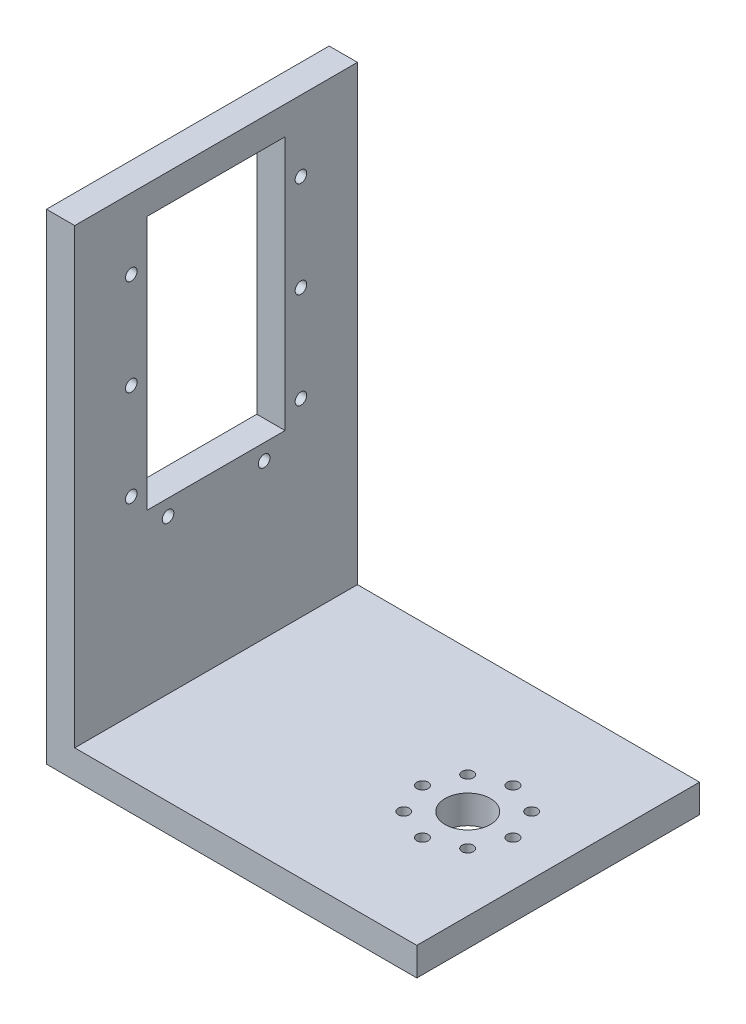
ISO-10303-21;
HEADER;
FILE_DESCRIPTION(('STEP AP214'),'2;1');
FILE_NAME('part.step','',(''),(''),'','','');
FILE_SCHEMA(('AUTOMOTIVE_DESIGN { 1 0 10303 214 1 1 1 1 }'));
ENDSEC;
DATA;
#1=APPLICATION_CONTEXT('core data for automotive mechanical design processes');
#2=APPLICATION_PROTOCOL_DEFINITION('international standard','automotive_design',2000,#1);
#3=PRODUCT_CONTEXT('',#1,'mechanical');
#4=PRODUCT('Part','Part','',(#3));
#5=PRODUCT_RELATED_PRODUCT_CATEGORY('part','',(#4));
#6=PRODUCT_DEFINITION_FORMATION('','',#4);
#7=PRODUCT_DEFINITION_CONTEXT('part definition',#1,'design');
#8=PRODUCT_DEFINITION('design','',#6,#7);
#9=PRODUCT_DEFINITION_SHAPE('','',#8);
#10=(LENGTH_UNIT() NAMED_UNIT(*) SI_UNIT(.MILLI.,.METRE.));
#11=(NAMED_UNIT(*) PLANE_ANGLE_UNIT() SI_UNIT($,.RADIAN.));
#12=(NAMED_UNIT(*) SI_UNIT($,.STERADIAN.) SOLID_ANGLE_UNIT());
#13=UNCERTAINTY_MEASURE_WITH_UNIT(LENGTH_MEASURE(1.E-05),#10,'distance_accuracy_value','');
#14=(GEOMETRIC_REPRESENTATION_CONTEXT(3) GLOBAL_UNCERTAINTY_ASSIGNED_CONTEXT((#13)) GLOBAL_UNIT_ASSIGNED_CONTEXT((#10,
#11,#12)) REPRESENTATION_CONTEXT('',''));
#15=CARTESIAN_POINT('',(0.,0.,0.));
#16=DIRECTION('',(0.,0.,1.));
#17=DIRECTION('',(1.,0.,0.));
#18=AXIS2_PLACEMENT_3D('',#15,#16,#17);
#19=CARTESIAN_POINT('',(0.,5.,0.));
#20=DIRECTION('',(0.,-1.,0.));
#21=DIRECTION('',(0.,0.,-1.));
#22=AXIS2_PLACEMENT_3D('',#19,#20,#21);
#23=PLANE('',#22);
#24=CARTESIAN_POINT('',(43.8431457505076,5.,-30.6568542494924));
#25=DIRECTION('',(0.,1.,0.));
#26=DIRECTION('',(0.,0.,1.));
#27=AXIS2_PLACEMENT_3D('',#24,#25,#26);
#28=CIRCLE('',#27,0.999999999999998);
#29=CARTESIAN_POINT('',(43.8431457505076,5.,-29.6568542494924));
#30=VERTEX_POINT('',#29);
#31=EDGE_CURVE('E166',#30,#30,#28,.T.);
#32=ORIENTED_EDGE('',*,*,#31,.F.);
#33=EDGE_LOOP('',(#32));
#34=FACE_BOUND('',#33,.T.);
#35=CARTESIAN_POINT('',(41.5,5.,-25.));
#36=DIRECTION('',(0.,1.,0.));
#37=DIRECTION('',(0.,0.,1.));
#38=AXIS2_PLACEMENT_3D('',#35,#36,#37);
#39=CIRCLE('',#38,0.999999999999998);
#40=CARTESIAN_POINT('',(41.5,5.,-24.));
#41=VERTEX_POINT('',#40);
#42=EDGE_CURVE('E172',#41,#41,#39,.T.);
#43=ORIENTED_EDGE('',*,*,#42,.F.);
#44=EDGE_LOOP('',(#43));
#45=FACE_BOUND('',#44,.T.);
#46=CARTESIAN_POINT('',(43.8431457505076,5.,-19.3431457505076));
#47=DIRECTION('',(0.,1.,0.));
#48=DIRECTION('',(0.,0.,1.));
#49=AXIS2_PLACEMENT_3D('',#46,#47,#48);
#50=CIRCLE('',#49,0.999999999999998);
#51=CARTESIAN_POINT('',(43.8431457505076,5.,-18.3431457505076));
#52=VERTEX_POINT('',#51);
#53=EDGE_CURVE('E178',#52,#52,#50,.T.);
#54=ORIENTED_EDGE('',*,*,#53,.F.);
#55=EDGE_LOOP('',(#54));
#56=FACE_BOUND('',#55,.T.);
#57=CARTESIAN_POINT('',(49.5,5.,-17.));
#58=DIRECTION('',(0.,1.,0.));
#59=DIRECTION('',(0.,0.,1.));
#60=AXIS2_PLACEMENT_3D('',#57,#58,#59);
#61=CIRCLE('',#60,0.999999999999998);
#62=CARTESIAN_POINT('',(49.5,5.,-16.));
#63=VERTEX_POINT('',#62);
#64=EDGE_CURVE('E184',#63,#63,#61,.T.);
#65=ORIENTED_EDGE('',*,*,#64,.F.);
#66=EDGE_LOOP('',(#65));
#67=FACE_BOUND('',#66,.T.);
#68=CARTESIAN_POINT('',(55.1568542494924,5.,-19.3431457505076));
#69=DIRECTION('',(0.,1.,0.));
#70=DIRECTION('',(0.,0.,1.));
#71=AXIS2_PLACEMENT_3D('',#68,#69,#70);
#72=CIRCLE('',#71,0.999999999999998);
#73=CARTESIAN_POINT('',(55.1568542494924,5.,-18.3431457505076));
#74=VERTEX_POINT('',#73);
#75=EDGE_CURVE('E190',#74,#74,#72,.T.);
#76=ORIENTED_EDGE('',*,*,#75,.F.);
#77=EDGE_LOOP('',(#76));
#78=FACE_BOUND('',#77,.T.);
#79=CARTESIAN_POINT('',(57.5,5.,-25.));
#80=DIRECTION('',(0.,1.,0.));
#81=DIRECTION('',(0.,0.,1.));
#82=AXIS2_PLACEMENT_3D('',#79,#80,#81);
#83=CIRCLE('',#82,0.999999999999998);
#84=CARTESIAN_POINT('',(57.5,5.,-24.));
#85=VERTEX_POINT('',#84);
#86=EDGE_CURVE('E196',#85,#85,#83,.T.);
#87=ORIENTED_EDGE('',*,*,#86,.F.);
#88=EDGE_LOOP('',(#87));
#89=FACE_BOUND('',#88,.T.);
#90=CARTESIAN_POINT('',(55.1568542494924,5.,-30.6568542494924));
#91=DIRECTION('',(0.,1.,0.));
#92=DIRECTION('',(0.,0.,1.));
#93=AXIS2_PLACEMENT_3D('',#90,#91,#92);
#94=CIRCLE('',#93,0.999999999999998);
#95=CARTESIAN_POINT('',(55.1568542494924,5.,-29.6568542494924));
#96=VERTEX_POINT('',#95);
#97=EDGE_CURVE('E202',#96,#96,#94,.T.);
#98=ORIENTED_EDGE('',*,*,#97,.F.);
#99=EDGE_LOOP('',(#98));
#100=FACE_BOUND('',#99,.T.);
#101=CARTESIAN_POINT('',(49.5,5.,-33.));
#102=DIRECTION('',(0.,1.,0.));
#103=DIRECTION('',(0.,0.,1.));
#104=AXIS2_PLACEMENT_3D('',#101,#102,#103);
#105=CIRCLE('',#104,0.999999999999998);
#106=CARTESIAN_POINT('',(49.5,5.,-32.));
#107=VERTEX_POINT('',#106);
#108=EDGE_CURVE('E208',#107,#107,#105,.T.);
#109=ORIENTED_EDGE('',*,*,#108,.F.);
#110=EDGE_LOOP('',(#109));
#111=FACE_BOUND('',#110,.T.);
#112=CARTESIAN_POINT('',(49.5,5.,-25.));
#113=DIRECTION('',(0.,1.,0.));
#114=DIRECTION('',(0.,0.,1.));
#115=AXIS2_PLACEMENT_3D('',#112,#113,#114);
#116=CIRCLE('',#115,4.00000000000001);
#117=CARTESIAN_POINT('',(49.5,5.,-21.));
#118=VERTEX_POINT('',#117);
#119=EDGE_CURVE('E214',#118,#118,#116,.T.);
#120=ORIENTED_EDGE('',*,*,#119,.F.);
#121=EDGE_LOOP('',(#120));
#122=FACE_BOUND('',#121,.T.);
#123=DIRECTION('',(0.,0.,-1.));
#124=VECTOR('',#123,1.);
#125=CARTESIAN_POINT('',(5.,5.,0.));
#126=LINE('',#125,#124);
#127=CARTESIAN_POINT('',(5.,5.,0.));
#128=VERTEX_POINT('',#127);
#129=CARTESIAN_POINT('',(5.,5.,-50.));
#130=VERTEX_POINT('',#129);
#131=EDGE_CURVE('E162',#128,#130,#126,.T.);
#132=ORIENTED_EDGE('',*,*,#131,.F.);
#133=DIRECTION('',(1.,0.,0.));
#134=VECTOR('',#133,1.);
#135=CARTESIAN_POINT('',(0.,5.,0.));
#136=LINE('',#135,#134);
#137=CARTESIAN_POINT('',(65.5,5.,0.));
#138=VERTEX_POINT('',#137);
#139=EDGE_CURVE('E220',#128,#138,#136,.T.);
#140=ORIENTED_EDGE('',*,*,#139,.T.);
#141=DIRECTION('',(0.,0.,-1.));
#142=VECTOR('',#141,1.);
#143=CARTESIAN_POINT('',(65.5,5.,0.));
#144=LINE('',#143,#142);
#145=CARTESIAN_POINT('',(65.5,5.,-50.));
#146=VERTEX_POINT('',#145);
#147=EDGE_CURVE('E222',#138,#146,#144,.T.);
#148=ORIENTED_EDGE('',*,*,#147,.T.);
#149=DIRECTION('',(-1.,0.,0.));
#150=VECTOR('',#149,1.);
#151=CARTESIAN_POINT('',(0.,5.,-50.));
#152=LINE('',#151,#150);
#153=EDGE_CURVE('E225',#146,#130,#152,.T.);
#154=ORIENTED_EDGE('',*,*,#153,.T.);
#155=EDGE_LOOP('',(#132,#140,#148,#154));
#156=FACE_BOUND('',#155,.T.);
#157=ADVANCED_FACE('F39',(#34,#45,#56,#67,#78,#89,#100,#111,#122,#156),#23,.F.);
#158=CARTESIAN_POINT('',(0.,0.,0.));
#159=DIRECTION('',(0.,-1.,0.));
#160=DIRECTION('',(0.,0.,-1.));
#161=AXIS2_PLACEMENT_3D('',#158,#159,#160);
#162=PLANE('',#161);
#163=DIRECTION('',(0.,0.,1.));
#164=VECTOR('',#163,1.);
#165=CARTESIAN_POINT('',(0.,0.,0.));
#166=LINE('',#165,#164);
#167=CARTESIAN_POINT('',(0.,0.,-50.));
#168=VERTEX_POINT('',#167);
#169=CARTESIAN_POINT('',(0.,0.,0.));
#170=VERTEX_POINT('',#169);
#171=EDGE_CURVE('E217',#168,#170,#166,.T.);
#172=ORIENTED_EDGE('',*,*,#171,.F.);
#173=DIRECTION('',(-1.,0.,0.));
#174=VECTOR('',#173,1.);
#175=CARTESIAN_POINT('',(0.,0.,-50.));
#176=LINE('',#175,#174);
#177=CARTESIAN_POINT('',(65.5,0.,-50.));
#178=VERTEX_POINT('',#177);
#179=EDGE_CURVE('E223',#178,#168,#176,.T.);
#180=ORIENTED_EDGE('',*,*,#179,.F.);
#181=DIRECTION('',(0.,0.,-1.));
#182=VECTOR('',#181,1.);
#183=CARTESIAN_POINT('',(65.5,0.,0.));
#184=LINE('',#183,#182);
#185=CARTESIAN_POINT('',(65.5,0.,0.));
#186=VERTEX_POINT('',#185);
#187=EDGE_CURVE('E232',#186,#178,#184,.T.);
#188=ORIENTED_EDGE('',*,*,#187,.F.);
#189=DIRECTION('',(1.,0.,0.));
#190=VECTOR('',#189,1.);
#191=CARTESIAN_POINT('',(0.,0.,0.));
#192=LINE('',#191,#190);
#193=EDGE_CURVE('E230',#170,#186,#192,.T.);
#194=ORIENTED_EDGE('',*,*,#193,.F.);
#195=EDGE_LOOP('',(#172,#180,#188,#194));
#196=FACE_BOUND('',#195,.T.);
#197=CARTESIAN_POINT('',(41.5,0.,-25.));
#198=DIRECTION('',(0.,1.,0.));
#199=DIRECTION('',(0.,0.,1.));
#200=AXIS2_PLACEMENT_3D('',#197,#198,#199);
#201=CIRCLE('',#200,0.999999999999998);
#202=CARTESIAN_POINT('',(41.5,0.,-24.));
#203=VERTEX_POINT('',#202);
#204=EDGE_CURVE('E169',#203,#203,#201,.T.);
#205=ORIENTED_EDGE('',*,*,#204,.T.);
#206=EDGE_LOOP('',(#205));
#207=FACE_BOUND('',#206,.T.);
#208=CARTESIAN_POINT('',(49.5,0.,-17.));
#209=DIRECTION('',(0.,1.,0.));
#210=DIRECTION('',(0.,0.,1.));
#211=AXIS2_PLACEMENT_3D('',#208,#209,#210);
#212=CIRCLE('',#211,0.999999999999998);
#213=CARTESIAN_POINT('',(49.5,0.,-16.));
#214=VERTEX_POINT('',#213);
#215=EDGE_CURVE('E181',#214,#214,#212,.T.);
#216=ORIENTED_EDGE('',*,*,#215,.T.);
#217=EDGE_LOOP('',(#216));
#218=FACE_BOUND('',#217,.T.);
#219=CARTESIAN_POINT('',(57.5,0.,-25.));
#220=DIRECTION('',(0.,1.,0.));
#221=DIRECTION('',(0.,0.,1.));
#222=AXIS2_PLACEMENT_3D('',#219,#220,#221);
#223=CIRCLE('',#222,0.999999999999998);
#224=CARTESIAN_POINT('',(57.5,0.,-24.));
#225=VERTEX_POINT('',#224);
#226=EDGE_CURVE('E193',#225,#225,#223,.T.);
#227=ORIENTED_EDGE('',*,*,#226,.T.);
#228=EDGE_LOOP('',(#227));
#229=FACE_BOUND('',#228,.T.);
#230=CARTESIAN_POINT('',(49.5,0.,-33.));
#231=DIRECTION('',(0.,1.,0.));
#232=DIRECTION('',(0.,0.,1.));
#233=AXIS2_PLACEMENT_3D('',#230,#231,#232);
#234=CIRCLE('',#233,0.999999999999998);
#235=CARTESIAN_POINT('',(49.5,0.,-32.));
#236=VERTEX_POINT('',#235);
#237=EDGE_CURVE('E205',#236,#236,#234,.T.);
#238=ORIENTED_EDGE('',*,*,#237,.T.);
#239=EDGE_LOOP('',(#238));
#240=FACE_BOUND('',#239,.T.);
#241=CARTESIAN_POINT('',(49.5,0.,-25.));
#242=DIRECTION('',(0.,1.,0.));
#243=DIRECTION('',(0.,0.,1.));
#244=AXIS2_PLACEMENT_3D('',#241,#242,#243);
#245=CIRCLE('',#244,4.00000000000001);
#246=CARTESIAN_POINT('',(49.5,0.,-21.));
#247=VERTEX_POINT('',#246);
#248=EDGE_CURVE('E211',#247,#247,#245,.T.);
#249=ORIENTED_EDGE('',*,*,#248,.T.);
#250=EDGE_LOOP('',(#249));
#251=FACE_BOUND('',#250,.T.);
#252=CARTESIAN_POINT('',(55.1568542494924,0.,-30.6568542494924));
#253=DIRECTION('',(0.,1.,0.));
#254=DIRECTION('',(0.,0.,1.));
#255=AXIS2_PLACEMENT_3D('',#252,#253,#254);
#256=CIRCLE('',#255,0.999999999999998);
#257=CARTESIAN_POINT('',(55.1568542494924,0.,-29.6568542494924));
#258=VERTEX_POINT('',#257);
#259=EDGE_CURVE('E199',#258,#258,#256,.T.);
#260=ORIENTED_EDGE('',*,*,#259,.T.);
#261=EDGE_LOOP('',(#260));
#262=FACE_BOUND('',#261,.T.);
#263=CARTESIAN_POINT('',(55.1568542494924,0.,-19.3431457505076));
#264=DIRECTION('',(0.,1.,0.));
#265=DIRECTION('',(0.,0.,1.));
#266=AXIS2_PLACEMENT_3D('',#263,#264,#265);
#267=CIRCLE('',#266,0.999999999999998);
#268=CARTESIAN_POINT('',(55.1568542494924,0.,-18.3431457505076));
#269=VERTEX_POINT('',#268);
#270=EDGE_CURVE('E187',#269,#269,#267,.T.);
#271=ORIENTED_EDGE('',*,*,#270,.T.);
#272=EDGE_LOOP('',(#271));
#273=FACE_BOUND('',#272,.T.);
#274=CARTESIAN_POINT('',(43.8431457505076,0.,-19.3431457505076));
#275=DIRECTION('',(0.,1.,0.));
#276=DIRECTION('',(0.,0.,1.));
#277=AXIS2_PLACEMENT_3D('',#274,#275,#276);
#278=CIRCLE('',#277,0.999999999999998);
#279=CARTESIAN_POINT('',(43.8431457505076,0.,-18.3431457505076));
#280=VERTEX_POINT('',#279);
#281=EDGE_CURVE('E175',#280,#280,#278,.T.);
#282=ORIENTED_EDGE('',*,*,#281,.T.);
#283=EDGE_LOOP('',(#282));
#284=FACE_BOUND('',#283,.T.);
#285=CARTESIAN_POINT('',(43.8431457505076,0.,-30.6568542494924));
#286=DIRECTION('',(0.,1.,0.));
#287=DIRECTION('',(0.,0.,1.));
#288=AXIS2_PLACEMENT_3D('',#285,#286,#287);
#289=CIRCLE('',#288,0.999999999999998);
#290=CARTESIAN_POINT('',(43.8431457505076,0.,-29.6568542494924));
#291=VERTEX_POINT('',#290);
#292=EDGE_CURVE('E165',#291,#291,#289,.T.);
#293=ORIENTED_EDGE('',*,*,#292,.T.);
#294=EDGE_LOOP('',(#293));
#295=FACE_BOUND('',#294,.T.);
#296=ADVANCED_FACE('F290',(#196,#207,#218,#229,#240,#251,#262,#273,#284,#295),#162,.T.);
#297=CARTESIAN_POINT('',(0.,5.,0.));
#298=DIRECTION('',(1.,0.,0.));
#299=DIRECTION('',(0.,0.,-1.));
#300=AXIS2_PLACEMENT_3D('',#297,#298,#299);
#301=PLANE('',#300);
#302=CARTESIAN_POINT('',(0.,72.5,-40.));
#303=DIRECTION('',(-1.,0.,0.));
#304=DIRECTION('',(0.,0.,1.));
#305=AXIS2_PLACEMENT_3D('',#302,#303,#304);
#306=CIRCLE('',#305,1.025);
#307=CARTESIAN_POINT('',(0.,72.5,-38.975));
#308=VERTEX_POINT('',#307);
#309=EDGE_CURVE('E614',#308,#308,#306,.T.);
#310=ORIENTED_EDGE('',*,*,#309,.F.);
#311=EDGE_LOOP('',(#310));
#312=FACE_BOUND('',#311,.T.);
#313=CARTESIAN_POINT('',(0.,72.5,-10.));
#314=DIRECTION('',(-1.,0.,0.));
#315=DIRECTION('',(0.,0.,1.));
#316=AXIS2_PLACEMENT_3D('',#313,#314,#315);
#317=CIRCLE('',#316,1.025);
#318=CARTESIAN_POINT('',(0.,72.5,-8.975));
#319=VERTEX_POINT('',#318);
#320=EDGE_CURVE('E615',#319,#319,#317,.T.);
#321=ORIENTED_EDGE('',*,*,#320,.F.);
#322=EDGE_LOOP('',(#321));
#323=FACE_BOUND('',#322,.T.);
#324=CARTESIAN_POINT('',(0.,55.5,-40.));
#325=DIRECTION('',(-1.,0.,0.));
#326=DIRECTION('',(0.,0.,1.));
#327=AXIS2_PLACEMENT_3D('',#324,#325,#326);
#328=CIRCLE('',#327,1.025);
#329=CARTESIAN_POINT('',(0.,55.5,-38.975));
#330=VERTEX_POINT('',#329);
#331=EDGE_CURVE('E599',#330,#330,#328,.T.);
#332=ORIENTED_EDGE('',*,*,#331,.F.);
#333=EDGE_LOOP('',(#332));
#334=FACE_BOUND('',#333,.T.);
#335=CARTESIAN_POINT('',(0.,38.5,-40.));
#336=DIRECTION('',(-1.,0.,0.));
#337=DIRECTION('',(0.,0.,1.));
#338=AXIS2_PLACEMENT_3D('',#335,#336,#337);
#339=CIRCLE('',#338,1.025);
#340=CARTESIAN_POINT('',(0.,38.5,-38.975));
#341=VERTEX_POINT('',#340);
#342=EDGE_CURVE('E618',#341,#341,#339,.T.);
#343=ORIENTED_EDGE('',*,*,#342,.F.);
#344=EDGE_LOOP('',(#343));
#345=FACE_BOUND('',#344,.T.);
#346=CARTESIAN_POINT('',(0.,38.5,-10.));
#347=DIRECTION('',(-1.,0.,0.));
#348=DIRECTION('',(0.,0.,-1.));
#349=AXIS2_PLACEMENT_3D('',#346,#347,#348);
#350=CIRCLE('',#349,1.025);
#351=CARTESIAN_POINT('',(0.,38.5,-11.025));
#352=VERTEX_POINT('',#351);
#353=EDGE_CURVE('E631',#352,#352,#350,.T.);
#354=ORIENTED_EDGE('',*,*,#353,.F.);
#355=EDGE_LOOP('',(#354));
#356=FACE_BOUND('',#355,.T.);
#357=CARTESIAN_POINT('',(0.,32.2,-33.5));
#358=DIRECTION('',(-1.,0.,0.));
#359=DIRECTION('',(0.,0.,1.));
#360=AXIS2_PLACEMENT_3D('',#357,#358,#359);
#361=CIRCLE('',#360,1.025);
#362=CARTESIAN_POINT('',(0.,32.2,-32.475));
#363=VERTEX_POINT('',#362);
#364=EDGE_CURVE('E628',#363,#363,#361,.T.);
#365=ORIENTED_EDGE('',*,*,#364,.F.);
#366=EDGE_LOOP('',(#365));
#367=FACE_BOUND('',#366,.T.);
#368=CARTESIAN_POINT('',(0.,55.5,-10.));
#369=DIRECTION('',(-1.,0.,0.));
#370=DIRECTION('',(0.,0.,1.));
#371=AXIS2_PLACEMENT_3D('',#368,#369,#370);
#372=CIRCLE('',#371,1.025);
#373=CARTESIAN_POINT('',(0.,55.5,-8.975));
#374=VERTEX_POINT('',#373);
#375=EDGE_CURVE('E625',#374,#374,#372,.T.);
#376=ORIENTED_EDGE('',*,*,#375,.F.);
#377=EDGE_LOOP('',(#376));
#378=FACE_BOUND('',#377,.T.);
#379=CARTESIAN_POINT('',(0.,32.2,-16.5));
#380=DIRECTION('',(-1.,0.,0.));
#381=DIRECTION('',(0.,0.,-1.));
#382=AXIS2_PLACEMENT_3D('',#379,#380,#381);
#383=CIRCLE('',#382,1.025);
#384=CARTESIAN_POINT('',(0.,32.2,-17.525));
#385=VERTEX_POINT('',#384);
#386=EDGE_CURVE('E621',#385,#385,#383,.T.);
#387=ORIENTED_EDGE('',*,*,#386,.F.);
#388=EDGE_LOOP('',(#387));
#389=FACE_BOUND('',#388,.T.);
#390=DIRECTION('',(0.,0.,1.));
#391=VECTOR('',#390,1.);
#392=CARTESIAN_POINT('',(0.,35.,-37.2));
#393=LINE('',#392,#391);
#394=CARTESIAN_POINT('',(0.,35.,-37.2));
#395=VERTEX_POINT('',#394);
#396=CARTESIAN_POINT('',(0.,35.,-12.8));
#397=VERTEX_POINT('',#396);
#398=EDGE_CURVE('E130',#395,#397,#393,.T.);
#399=ORIENTED_EDGE('',*,*,#398,.F.);
#400=DIRECTION('',(0.,-1.,0.));
#401=VECTOR('',#400,1.);
#402=CARTESIAN_POINT('',(0.,35.,-37.2));
#403=LINE('',#402,#401);
#404=CARTESIAN_POINT('',(0.,80.,-37.2));
#405=VERTEX_POINT('',#404);
#406=EDGE_CURVE('E56',#405,#395,#403,.T.);
#407=ORIENTED_EDGE('',*,*,#406,.F.);
#408=DIRECTION('',(0.,0.,-1.));
#409=VECTOR('',#408,1.);
#410=CARTESIAN_POINT('',(0.,80.,-37.2));
#411=LINE('',#410,#409);
#412=CARTESIAN_POINT('',(0.,80.,-12.8));
#413=VERTEX_POINT('',#412);
#414=EDGE_CURVE('E136',#413,#405,#411,.T.);
#415=ORIENTED_EDGE('',*,*,#414,.F.);
#416=DIRECTION('',(0.,1.,0.));
#417=VECTOR('',#416,1.);
#418=CARTESIAN_POINT('',(0.,35.,-12.8));
#419=LINE('',#418,#417);
#420=EDGE_CURVE('E121',#397,#413,#419,.T.);
#421=ORIENTED_EDGE('',*,*,#420,.F.);
#422=EDGE_LOOP('',(#399,#407,#415,#421));
#423=FACE_BOUND('',#422,.T.);
#424=ORIENTED_EDGE('',*,*,#171,.T.);
#425=DIRECTION('',(0.,-1.,0.));
#426=VECTOR('',#425,1.);
#427=CARTESIAN_POINT('',(0.,5.,0.));
#428=LINE('',#427,#426);
#429=CARTESIAN_POINT('',(0.,85.,0.));
#430=VERTEX_POINT('',#429);
#431=EDGE_CURVE('E243',#430,#170,#428,.T.);
#432=ORIENTED_EDGE('',*,*,#431,.F.);
#433=DIRECTION('',(0.,0.,1.));
#434=VECTOR('',#433,1.);
#435=CARTESIAN_POINT('',(0.,85.,0.));
#436=LINE('',#435,#434);
#437=CARTESIAN_POINT('',(0.,85.,-50.));
#438=VERTEX_POINT('',#437);
#439=EDGE_CURVE('E146',#438,#430,#436,.T.);
#440=ORIENTED_EDGE('',*,*,#439,.F.);
#441=DIRECTION('',(0.,-1.,0.));
#442=VECTOR('',#441,1.);
#443=CARTESIAN_POINT('',(0.,5.,-50.));
#444=LINE('',#443,#442);
#445=EDGE_CURVE('E227',#438,#168,#444,.T.);
#446=ORIENTED_EDGE('',*,*,#445,.T.);
#447=EDGE_LOOP('',(#424,#432,#440,#446));
#448=FACE_BOUND('',#447,.T.);
#449=ADVANCED_FACE('F41',(#312,#323,#334,#345,#356,#367,#378,#389,#423,#448),#301,.F.);
#450=CARTESIAN_POINT('',(0.,5.,0.));
#451=DIRECTION('',(0.,0.,-1.));
#452=DIRECTION('',(-1.,0.,0.));
#453=AXIS2_PLACEMENT_3D('',#450,#451,#452);
#454=PLANE('',#453);
#455=ORIENTED_EDGE('',*,*,#193,.T.);
#456=DIRECTION('',(0.,-1.,0.));
#457=VECTOR('',#456,1.);
#458=CARTESIAN_POINT('',(65.5,5.,0.));
#459=LINE('',#458,#457);
#460=EDGE_CURVE('E240',#138,#186,#459,.T.);
#461=ORIENTED_EDGE('',*,*,#460,.F.);
#462=ORIENTED_EDGE('',*,*,#139,.F.);
#463=DIRECTION('',(0.,-1.,0.));
#464=VECTOR('',#463,1.);
#465=CARTESIAN_POINT('',(5.,85.,0.));
#466=LINE('',#465,#464);
#467=CARTESIAN_POINT('',(5.,85.,0.));
#468=VERTEX_POINT('',#467);
#469=EDGE_CURVE('E159',#468,#128,#466,.T.);
#470=ORIENTED_EDGE('',*,*,#469,.F.);
#471=DIRECTION('',(1.,0.,0.));
#472=VECTOR('',#471,1.);
#473=CARTESIAN_POINT('',(0.,85.,0.));
#474=LINE('',#473,#472);
#475=EDGE_CURVE('E149',#430,#468,#474,.T.);
#476=ORIENTED_EDGE('',*,*,#475,.F.);
#477=ORIENTED_EDGE('',*,*,#431,.T.);
#478=EDGE_LOOP('',(#455,#461,#462,#470,#476,#477));
#479=FACE_BOUND('',#478,.T.);
#480=ADVANCED_FACE('F310',(#479),#454,.F.);
#481=CARTESIAN_POINT('',(65.5,5.,0.));
#482=DIRECTION('',(-1.,0.,0.));
#483=DIRECTION('',(0.,0.,1.));
#484=AXIS2_PLACEMENT_3D('',#481,#482,#483);
#485=PLANE('',#484);
#486=ORIENTED_EDGE('',*,*,#187,.T.);
#487=DIRECTION('',(0.,-1.,0.));
#488=VECTOR('',#487,1.);
#489=CARTESIAN_POINT('',(65.5,5.,-50.));
#490=LINE('',#489,#488);
#491=EDGE_CURVE('E237',#146,#178,#490,.T.);
#492=ORIENTED_EDGE('',*,*,#491,.F.);
#493=ORIENTED_EDGE('',*,*,#147,.F.);
#494=ORIENTED_EDGE('',*,*,#460,.T.);
#495=EDGE_LOOP('',(#486,#492,#493,#494));
#496=FACE_BOUND('',#495,.T.);
#497=ADVANCED_FACE('F307',(#496),#485,.F.);
#498=CARTESIAN_POINT('',(0.,5.,-50.));
#499=DIRECTION('',(0.,0.,1.));
#500=DIRECTION('',(1.,0.,0.));
#501=AXIS2_PLACEMENT_3D('',#498,#499,#500);
#502=PLANE('',#501);
#503=ORIENTED_EDGE('',*,*,#445,.F.);
#504=DIRECTION('',(-1.,0.,0.));
#505=VECTOR('',#504,1.);
#506=CARTESIAN_POINT('',(0.,85.,-50.));
#507=LINE('',#506,#505);
#508=CARTESIAN_POINT('',(5.,85.,-50.));
#509=VERTEX_POINT('',#508);
#510=EDGE_CURVE('E153',#509,#438,#507,.T.);
#511=ORIENTED_EDGE('',*,*,#510,.F.);
#512=DIRECTION('',(0.,-1.,0.));
#513=VECTOR('',#512,1.);
#514=CARTESIAN_POINT('',(5.,85.,-50.));
#515=LINE('',#514,#513);
#516=EDGE_CURVE('E156',#509,#130,#515,.T.);
#517=ORIENTED_EDGE('',*,*,#516,.T.);
#518=ORIENTED_EDGE('',*,*,#153,.F.);
#519=ORIENTED_EDGE('',*,*,#491,.T.);
#520=ORIENTED_EDGE('',*,*,#179,.T.);
#521=EDGE_LOOP('',(#503,#511,#517,#518,#519,#520));
#522=FACE_BOUND('',#521,.T.);
#523=ADVANCED_FACE('F304',(#522),#502,.F.);
#524=CARTESIAN_POINT('',(49.5,5.,-25.));
#525=DIRECTION('',(0.,-1.,0.));
#526=DIRECTION('',(0.,0.,-1.));
#527=AXIS2_PLACEMENT_3D('',#524,#525,#526);
#528=CYLINDRICAL_SURFACE('',#527,4.00000000000001);
#529=ORIENTED_EDGE('',*,*,#119,.T.);
#530=EDGE_LOOP('',(#529));
#531=FACE_BOUND('',#530,.T.);
#532=ORIENTED_EDGE('',*,*,#248,.F.);
#533=EDGE_LOOP('',(#532));
#534=FACE_BOUND('',#533,.T.);
#535=ADVANCED_FACE('F301',(#531,#534),#528,.F.);
#536=CARTESIAN_POINT('',(49.5,5.,-33.));
#537=DIRECTION('',(0.,-1.,0.));
#538=DIRECTION('',(0.,0.,-1.));
#539=AXIS2_PLACEMENT_3D('',#536,#537,#538);
#540=CYLINDRICAL_SURFACE('',#539,0.999999999999998);
#541=ORIENTED_EDGE('',*,*,#108,.T.);
#542=EDGE_LOOP('',(#541));
#543=FACE_BOUND('',#542,.T.);
#544=ORIENTED_EDGE('',*,*,#237,.F.);
#545=EDGE_LOOP('',(#544));
#546=FACE_BOUND('',#545,.T.);
#547=ADVANCED_FACE('F372',(#543,#546),#540,.F.);
#548=CARTESIAN_POINT('',(55.1568542494924,5.,-30.6568542494924));
#549=DIRECTION('',(0.,-1.,0.));
#550=DIRECTION('',(0.,0.,-1.));
#551=AXIS2_PLACEMENT_3D('',#548,#549,#550);
#552=CYLINDRICAL_SURFACE('',#551,0.999999999999998);
#553=ORIENTED_EDGE('',*,*,#97,.T.);
#554=EDGE_LOOP('',(#553));
#555=FACE_BOUND('',#554,.T.);
#556=ORIENTED_EDGE('',*,*,#259,.F.);
#557=EDGE_LOOP('',(#556));
#558=FACE_BOUND('',#557,.T.);
#559=ADVANCED_FACE('F369',(#555,#558),#552,.F.);
#560=CARTESIAN_POINT('',(57.5,5.,-25.));
#561=DIRECTION('',(0.,-1.,0.));
#562=DIRECTION('',(0.,0.,-1.));
#563=AXIS2_PLACEMENT_3D('',#560,#561,#562);
#564=CYLINDRICAL_SURFACE('',#563,0.999999999999998);
#565=ORIENTED_EDGE('',*,*,#86,.T.);
#566=EDGE_LOOP('',(#565));
#567=FACE_BOUND('',#566,.T.);
#568=ORIENTED_EDGE('',*,*,#226,.F.);
#569=EDGE_LOOP('',(#568));
#570=FACE_BOUND('',#569,.T.);
#571=ADVANCED_FACE('F365',(#567,#570),#564,.F.);
#572=CARTESIAN_POINT('',(55.1568542494924,5.,-19.3431457505076));
#573=DIRECTION('',(0.,-1.,0.));
#574=DIRECTION('',(0.,0.,-1.));
#575=AXIS2_PLACEMENT_3D('',#572,#573,#574);
#576=CYLINDRICAL_SURFACE('',#575,0.999999999999998);
#577=ORIENTED_EDGE('',*,*,#75,.T.);
#578=EDGE_LOOP('',(#577));
#579=FACE_BOUND('',#578,.T.);
#580=ORIENTED_EDGE('',*,*,#270,.F.);
#581=EDGE_LOOP('',(#580));
#582=FACE_BOUND('',#581,.T.);
#583=ADVANCED_FACE('F361',(#579,#582),#576,.F.);
#584=CARTESIAN_POINT('',(49.5,5.,-17.));
#585=DIRECTION('',(0.,-1.,0.));
#586=DIRECTION('',(0.,0.,-1.));
#587=AXIS2_PLACEMENT_3D('',#584,#585,#586);
#588=CYLINDRICAL_SURFACE('',#587,0.999999999999998);
#589=ORIENTED_EDGE('',*,*,#64,.T.);
#590=EDGE_LOOP('',(#589));
#591=FACE_BOUND('',#590,.T.);
#592=ORIENTED_EDGE('',*,*,#215,.F.);
#593=EDGE_LOOP('',(#592));
#594=FACE_BOUND('',#593,.T.);
#595=ADVANCED_FACE('F357',(#591,#594),#588,.F.);
#596=CARTESIAN_POINT('',(43.8431457505076,5.,-19.3431457505076));
#597=DIRECTION('',(0.,-1.,0.));
#598=DIRECTION('',(0.,0.,-1.));
#599=AXIS2_PLACEMENT_3D('',#596,#597,#598);
#600=CYLINDRICAL_SURFACE('',#599,0.999999999999998);
#601=ORIENTED_EDGE('',*,*,#53,.T.);
#602=EDGE_LOOP('',(#601));
#603=FACE_BOUND('',#602,.T.);
#604=ORIENTED_EDGE('',*,*,#281,.F.);
#605=EDGE_LOOP('',(#604));
#606=FACE_BOUND('',#605,.T.);
#607=ADVANCED_FACE('F353',(#603,#606),#600,.F.);
#608=CARTESIAN_POINT('',(41.5,5.,-25.));
#609=DIRECTION('',(0.,-1.,0.));
#610=DIRECTION('',(0.,0.,-1.));
#611=AXIS2_PLACEMENT_3D('',#608,#609,#610);
#612=CYLINDRICAL_SURFACE('',#611,0.999999999999998);
#613=ORIENTED_EDGE('',*,*,#42,.T.);
#614=EDGE_LOOP('',(#613));
#615=FACE_BOUND('',#614,.T.);
#616=ORIENTED_EDGE('',*,*,#204,.F.);
#617=EDGE_LOOP('',(#616));
#618=FACE_BOUND('',#617,.T.);
#619=ADVANCED_FACE('F346',(#615,#618),#612,.F.);
#620=CARTESIAN_POINT('',(43.8431457505076,5.,-30.6568542494924));
#621=DIRECTION('',(0.,-1.,0.));
#622=DIRECTION('',(0.,0.,-1.));
#623=AXIS2_PLACEMENT_3D('',#620,#621,#622);
#624=CYLINDRICAL_SURFACE('',#623,0.999999999999998);
#625=ORIENTED_EDGE('',*,*,#31,.T.);
#626=EDGE_LOOP('',(#625));
#627=FACE_BOUND('',#626,.T.);
#628=ORIENTED_EDGE('',*,*,#292,.F.);
#629=EDGE_LOOP('',(#628));
#630=FACE_BOUND('',#629,.T.);
#631=ADVANCED_FACE('F338',(#627,#630),#624,.F.);
#632=CARTESIAN_POINT('',(5.,85.,0.));
#633=DIRECTION('',(-1.,0.,0.));
#634=DIRECTION('',(0.,0.,1.));
#635=AXIS2_PLACEMENT_3D('',#632,#633,#634);
#636=PLANE('',#635);
#637=CARTESIAN_POINT('',(5.,72.5,-40.));
#638=DIRECTION('',(-1.,0.,0.));
#639=DIRECTION('',(0.,0.,1.));
#640=AXIS2_PLACEMENT_3D('',#637,#638,#639);
#641=CIRCLE('',#640,1.025);
#642=CARTESIAN_POINT('',(5.,72.5,-38.975));
#643=VERTEX_POINT('',#642);
#644=EDGE_CURVE('E43',#643,#643,#641,.T.);
#645=ORIENTED_EDGE('',*,*,#644,.T.);
#646=EDGE_LOOP('',(#645));
#647=FACE_BOUND('',#646,.T.);
#648=CARTESIAN_POINT('',(5.,72.5,-10.));
#649=DIRECTION('',(-1.,0.,0.));
#650=DIRECTION('',(0.,0.,1.));
#651=AXIS2_PLACEMENT_3D('',#648,#649,#650);
#652=CIRCLE('',#651,1.025);
#653=CARTESIAN_POINT('',(5.,72.5,-8.975));
#654=VERTEX_POINT('',#653);
#655=EDGE_CURVE('E267',#654,#654,#652,.T.);
#656=ORIENTED_EDGE('',*,*,#655,.T.);
#657=EDGE_LOOP('',(#656));
#658=FACE_BOUND('',#657,.T.);
#659=CARTESIAN_POINT('',(5.,55.5,-40.));
#660=DIRECTION('',(-1.,0.,0.));
#661=DIRECTION('',(0.,0.,1.));
#662=AXIS2_PLACEMENT_3D('',#659,#660,#661);
#663=CIRCLE('',#662,1.025);
#664=CARTESIAN_POINT('',(5.,55.5,-38.975));
#665=VERTEX_POINT('',#664);
#666=EDGE_CURVE('E265',#665,#665,#663,.T.);
#667=ORIENTED_EDGE('',*,*,#666,.T.);
#668=EDGE_LOOP('',(#667));
#669=FACE_BOUND('',#668,.T.);
#670=CARTESIAN_POINT('',(5.,38.5,-40.));
#671=DIRECTION('',(-1.,0.,0.));
#672=DIRECTION('',(0.,0.,1.));
#673=AXIS2_PLACEMENT_3D('',#670,#671,#672);
#674=CIRCLE('',#673,1.025);
#675=CARTESIAN_POINT('',(5.,38.5,-38.975));
#676=VERTEX_POINT('',#675);
#677=EDGE_CURVE('E262',#676,#676,#674,.T.);
#678=ORIENTED_EDGE('',*,*,#677,.T.);
#679=EDGE_LOOP('',(#678));
#680=FACE_BOUND('',#679,.T.);
#681=CARTESIAN_POINT('',(5.,38.5,-10.));
#682=DIRECTION('',(-1.,0.,0.));
#683=DIRECTION('',(0.,0.,1.));
#684=AXIS2_PLACEMENT_3D('',#681,#682,#683);
#685=CIRCLE('',#684,1.025);
#686=CARTESIAN_POINT('',(5.,38.5,-8.975));
#687=VERTEX_POINT('',#686);
#688=EDGE_CURVE('E259',#687,#687,#685,.T.);
#689=ORIENTED_EDGE('',*,*,#688,.T.);
#690=EDGE_LOOP('',(#689));
#691=FACE_BOUND('',#690,.T.);
#692=CARTESIAN_POINT('',(5.,32.2,-33.5));
#693=DIRECTION('',(-1.,0.,0.));
#694=DIRECTION('',(0.,0.,1.));
#695=AXIS2_PLACEMENT_3D('',#692,#693,#694);
#696=CIRCLE('',#695,1.025);
#697=CARTESIAN_POINT('',(5.,32.2,-32.475));
#698=VERTEX_POINT('',#697);
#699=EDGE_CURVE('E256',#698,#698,#696,.T.);
#700=ORIENTED_EDGE('',*,*,#699,.T.);
#701=EDGE_LOOP('',(#700));
#702=FACE_BOUND('',#701,.T.);
#703=CARTESIAN_POINT('',(5.,55.5,-10.));
#704=DIRECTION('',(-1.,0.,0.));
#705=DIRECTION('',(0.,0.,1.));
#706=AXIS2_PLACEMENT_3D('',#703,#704,#705);
#707=CIRCLE('',#706,1.025);
#708=CARTESIAN_POINT('',(5.,55.5,-8.975));
#709=VERTEX_POINT('',#708);
#710=EDGE_CURVE('E253',#709,#709,#707,.T.);
#711=ORIENTED_EDGE('',*,*,#710,.T.);
#712=EDGE_LOOP('',(#711));
#713=FACE_BOUND('',#712,.T.);
#714=CARTESIAN_POINT('',(5.,32.2,-16.5));
#715=DIRECTION('',(-1.,0.,0.));
#716=DIRECTION('',(0.,0.,1.));
#717=AXIS2_PLACEMENT_3D('',#714,#715,#716);
#718=CIRCLE('',#717,1.025);
#719=CARTESIAN_POINT('',(5.,32.2,-15.475));
#720=VERTEX_POINT('',#719);
#721=EDGE_CURVE('E143',#720,#720,#718,.T.);
#722=ORIENTED_EDGE('',*,*,#721,.T.);
#723=EDGE_LOOP('',(#722));
#724=FACE_BOUND('',#723,.T.);
#725=DIRECTION('',(0.,0.,-1.));
#726=VECTOR('',#725,1.);
#727=CARTESIAN_POINT('',(5.,80.,0.));
#728=LINE('',#727,#726);
#729=CARTESIAN_POINT('',(5.,80.,-12.8));
#730=VERTEX_POINT('',#729);
#731=CARTESIAN_POINT('',(5.,80.,-37.2));
#732=VERTEX_POINT('',#731);
#733=EDGE_CURVE('E48',#730,#732,#728,.T.);
#734=ORIENTED_EDGE('',*,*,#733,.T.);
#735=DIRECTION('',(0.,-1.,0.));
#736=VECTOR('',#735,1.);
#737=CARTESIAN_POINT('',(5.,85.,-37.2));
#738=LINE('',#737,#736);
#739=CARTESIAN_POINT('',(5.,35.,-37.2));
#740=VERTEX_POINT('',#739);
#741=EDGE_CURVE('E11',#732,#740,#738,.T.);
#742=ORIENTED_EDGE('',*,*,#741,.T.);
#743=DIRECTION('',(0.,0.,1.));
#744=VECTOR('',#743,1.);
#745=CARTESIAN_POINT('',(5.,35.,0.));
#746=LINE('',#745,#744);
#747=CARTESIAN_POINT('',(5.,35.,-12.8));
#748=VERTEX_POINT('',#747);
#749=EDGE_CURVE('E246',#740,#748,#746,.T.);
#750=ORIENTED_EDGE('',*,*,#749,.T.);
#751=DIRECTION('',(0.,1.,0.));
#752=VECTOR('',#751,1.);
#753=CARTESIAN_POINT('',(5.,85.,-12.8));
#754=LINE('',#753,#752);
#755=EDGE_CURVE('E124',#748,#730,#754,.T.);
#756=ORIENTED_EDGE('',*,*,#755,.T.);
#757=EDGE_LOOP('',(#734,#742,#750,#756));
#758=FACE_BOUND('',#757,.T.);
#759=ORIENTED_EDGE('',*,*,#469,.T.);
#760=ORIENTED_EDGE('',*,*,#131,.T.);
#761=ORIENTED_EDGE('',*,*,#516,.F.);
#762=DIRECTION('',(0.,0.,-1.));
#763=VECTOR('',#762,1.);
#764=CARTESIAN_POINT('',(5.,85.,0.));
#765=LINE('',#764,#763);
#766=EDGE_CURVE('E151',#468,#509,#765,.T.);
#767=ORIENTED_EDGE('',*,*,#766,.F.);
#768=EDGE_LOOP('',(#759,#760,#761,#767));
#769=FACE_BOUND('',#768,.T.);
#770=ADVANCED_FACE('F274',(#647,#658,#669,#680,#691,#702,#713,#724,#758,#769),#636,.F.);
#771=CARTESIAN_POINT('',(0.,85.,0.));
#772=DIRECTION('',(0.,-1.,0.));
#773=DIRECTION('',(0.,0.,-1.));
#774=AXIS2_PLACEMENT_3D('',#771,#772,#773);
#775=PLANE('',#774);
#776=ORIENTED_EDGE('',*,*,#439,.T.);
#777=ORIENTED_EDGE('',*,*,#475,.T.);
#778=ORIENTED_EDGE('',*,*,#766,.T.);
#779=ORIENTED_EDGE('',*,*,#510,.T.);
#780=EDGE_LOOP('',(#776,#777,#778,#779));
#781=FACE_BOUND('',#780,.T.);
#782=ADVANCED_FACE('F331',(#781),#775,.F.);
#783=CARTESIAN_POINT('',(65.5,35.,-37.2));
#784=DIRECTION('',(0.,0.,-1.));
#785=DIRECTION('',(-1.,0.,0.));
#786=AXIS2_PLACEMENT_3D('',#783,#784,#785);
#787=PLANE('',#786);
#788=DIRECTION('',(-1.,0.,0.));
#789=VECTOR('',#788,1.);
#790=CARTESIAN_POINT('',(65.5,80.,-37.2));
#791=LINE('',#790,#789);
#792=EDGE_CURVE('E141',#732,#405,#791,.T.);
#793=ORIENTED_EDGE('',*,*,#792,.T.);
#794=ORIENTED_EDGE('',*,*,#406,.T.);
#795=DIRECTION('',(-1.,0.,0.));
#796=VECTOR('',#795,1.);
#797=CARTESIAN_POINT('',(65.5,35.,-37.2));
#798=LINE('',#797,#796);
#799=EDGE_CURVE('E127',#740,#395,#798,.T.);
#800=ORIENTED_EDGE('',*,*,#799,.F.);
#801=ORIENTED_EDGE('',*,*,#741,.F.);
#802=EDGE_LOOP('',(#793,#794,#800,#801));
#803=FACE_BOUND('',#802,.T.);
#804=ADVANCED_FACE('F344',(#803),#787,.F.);
#805=CARTESIAN_POINT('',(65.5,80.,-37.2));
#806=DIRECTION('',(0.,1.,0.));
#807=DIRECTION('',(0.,0.,1.));
#808=AXIS2_PLACEMENT_3D('',#805,#806,#807);
#809=PLANE('',#808);
#810=DIRECTION('',(-1.,0.,0.));
#811=VECTOR('',#810,1.);
#812=CARTESIAN_POINT('',(65.5,80.,-12.8));
#813=LINE('',#812,#811);
#814=EDGE_CURVE('E126',#730,#413,#813,.T.);
#815=ORIENTED_EDGE('',*,*,#814,.T.);
#816=ORIENTED_EDGE('',*,*,#414,.T.);
#817=ORIENTED_EDGE('',*,*,#792,.F.);
#818=ORIENTED_EDGE('',*,*,#733,.F.);
#819=EDGE_LOOP('',(#815,#816,#817,#818));
#820=FACE_BOUND('',#819,.T.);
#821=ADVANCED_FACE('F500',(#820),#809,.F.);
#822=CARTESIAN_POINT('',(65.5,35.,-12.8));
#823=DIRECTION('',(0.,0.,1.));
#824=DIRECTION('',(0.,-1.,0.));
#825=AXIS2_PLACEMENT_3D('',#822,#823,#824);
#826=PLANE('',#825);
#827=DIRECTION('',(-1.,0.,0.));
#828=VECTOR('',#827,1.);
#829=CARTESIAN_POINT('',(65.5,35.,-12.8));
#830=LINE('',#829,#828);
#831=EDGE_CURVE('E64',#748,#397,#830,.T.);
#832=ORIENTED_EDGE('',*,*,#831,.T.);
#833=ORIENTED_EDGE('',*,*,#420,.T.);
#834=ORIENTED_EDGE('',*,*,#814,.F.);
#835=ORIENTED_EDGE('',*,*,#755,.F.);
#836=EDGE_LOOP('',(#832,#833,#834,#835));
#837=FACE_BOUND('',#836,.T.);
#838=ADVANCED_FACE('F118',(#837),#826,.F.);
#839=CARTESIAN_POINT('',(65.5,35.,-37.2));
#840=DIRECTION('',(0.,-1.,0.));
#841=DIRECTION('',(0.,0.,-1.));
#842=AXIS2_PLACEMENT_3D('',#839,#840,#841);
#843=PLANE('',#842);
#844=ORIENTED_EDGE('',*,*,#799,.T.);
#845=ORIENTED_EDGE('',*,*,#398,.T.);
#846=ORIENTED_EDGE('',*,*,#831,.F.);
#847=ORIENTED_EDGE('',*,*,#749,.F.);
#848=EDGE_LOOP('',(#844,#845,#846,#847));
#849=FACE_BOUND('',#848,.T.);
#850=ADVANCED_FACE('F131',(#849),#843,.F.);
#851=CARTESIAN_POINT('',(65.5,32.2,-16.5));
#852=DIRECTION('',(-1.,0.,0.));
#853=DIRECTION('',(0.,0.,1.));
#854=AXIS2_PLACEMENT_3D('',#851,#852,#853);
#855=CYLINDRICAL_SURFACE('',#854,1.025);
#856=ORIENTED_EDGE('',*,*,#386,.T.);
#857=EDGE_LOOP('',(#856));
#858=FACE_BOUND('',#857,.T.);
#859=ORIENTED_EDGE('',*,*,#721,.F.);
#860=EDGE_LOOP('',(#859));
#861=FACE_BOUND('',#860,.T.);
#862=ADVANCED_FACE('F525',(#858,#861),#855,.F.);
#863=CARTESIAN_POINT('',(65.5,55.5,-10.));
#864=DIRECTION('',(-1.,0.,0.));
#865=DIRECTION('',(0.,0.,1.));
#866=AXIS2_PLACEMENT_3D('',#863,#864,#865);
#867=CYLINDRICAL_SURFACE('',#866,1.025);
#868=ORIENTED_EDGE('',*,*,#375,.T.);
#869=EDGE_LOOP('',(#868));
#870=FACE_BOUND('',#869,.T.);
#871=ORIENTED_EDGE('',*,*,#710,.F.);
#872=EDGE_LOOP('',(#871));
#873=FACE_BOUND('',#872,.T.);
#874=ADVANCED_FACE('F534',(#870,#873),#867,.F.);
#875=CARTESIAN_POINT('',(65.5,32.2,-33.5));
#876=DIRECTION('',(-1.,0.,0.));
#877=DIRECTION('',(0.,0.,1.));
#878=AXIS2_PLACEMENT_3D('',#875,#876,#877);
#879=CYLINDRICAL_SURFACE('',#878,1.025);
#880=ORIENTED_EDGE('',*,*,#364,.T.);
#881=EDGE_LOOP('',(#880));
#882=FACE_BOUND('',#881,.T.);
#883=ORIENTED_EDGE('',*,*,#699,.F.);
#884=EDGE_LOOP('',(#883));
#885=FACE_BOUND('',#884,.T.);
#886=ADVANCED_FACE('F544',(#882,#885),#879,.F.);
#887=CARTESIAN_POINT('',(65.5,38.5,-10.));
#888=DIRECTION('',(-1.,0.,0.));
#889=DIRECTION('',(0.,0.,1.));
#890=AXIS2_PLACEMENT_3D('',#887,#888,#889);
#891=CYLINDRICAL_SURFACE('',#890,1.025);
#892=ORIENTED_EDGE('',*,*,#353,.T.);
#893=EDGE_LOOP('',(#892));
#894=FACE_BOUND('',#893,.T.);
#895=ORIENTED_EDGE('',*,*,#688,.F.);
#896=EDGE_LOOP('',(#895));
#897=FACE_BOUND('',#896,.T.);
#898=ADVANCED_FACE('F553',(#894,#897),#891,.F.);
#899=CARTESIAN_POINT('',(65.5,38.5,-40.));
#900=DIRECTION('',(-1.,0.,0.));
#901=DIRECTION('',(0.,0.,1.));
#902=AXIS2_PLACEMENT_3D('',#899,#900,#901);
#903=CYLINDRICAL_SURFACE('',#902,1.025);
#904=ORIENTED_EDGE('',*,*,#342,.T.);
#905=EDGE_LOOP('',(#904));
#906=FACE_BOUND('',#905,.T.);
#907=ORIENTED_EDGE('',*,*,#677,.F.);
#908=EDGE_LOOP('',(#907));
#909=FACE_BOUND('',#908,.T.);
#910=ADVANCED_FACE('F563',(#906,#909),#903,.F.);
#911=CARTESIAN_POINT('',(65.5,55.5,-40.));
#912=DIRECTION('',(-1.,0.,0.));
#913=DIRECTION('',(0.,0.,1.));
#914=AXIS2_PLACEMENT_3D('',#911,#912,#913);
#915=CYLINDRICAL_SURFACE('',#914,1.025);
#916=ORIENTED_EDGE('',*,*,#331,.T.);
#917=EDGE_LOOP('',(#916));
#918=FACE_BOUND('',#917,.T.);
#919=ORIENTED_EDGE('',*,*,#666,.F.);
#920=EDGE_LOOP('',(#919));
#921=FACE_BOUND('',#920,.T.);
#922=ADVANCED_FACE('F284',(#918,#921),#915,.F.);
#923=CARTESIAN_POINT('',(65.5,72.5,-10.));
#924=DIRECTION('',(-1.,0.,0.));
#925=DIRECTION('',(0.,0.,1.));
#926=AXIS2_PLACEMENT_3D('',#923,#924,#925);
#927=CYLINDRICAL_SURFACE('',#926,1.025);
#928=ORIENTED_EDGE('',*,*,#320,.T.);
#929=EDGE_LOOP('',(#928));
#930=FACE_BOUND('',#929,.T.);
#931=ORIENTED_EDGE('',*,*,#655,.F.);
#932=EDGE_LOOP('',(#931));
#933=FACE_BOUND('',#932,.T.);
#934=ADVANCED_FACE('F278',(#930,#933),#927,.F.);
#935=CARTESIAN_POINT('',(65.5,72.5,-40.));
#936=DIRECTION('',(-1.,0.,0.));
#937=DIRECTION('',(0.,0.,1.));
#938=AXIS2_PLACEMENT_3D('',#935,#936,#937);
#939=CYLINDRICAL_SURFACE('',#938,1.025);
#940=ORIENTED_EDGE('',*,*,#309,.T.);
#941=EDGE_LOOP('',(#940));
#942=FACE_BOUND('',#941,.T.);
#943=ORIENTED_EDGE('',*,*,#644,.F.);
#944=EDGE_LOOP('',(#943));
#945=FACE_BOUND('',#944,.T.);
#946=ADVANCED_FACE('F276',(#942,#945),#939,.F.);
#947=CLOSED_SHELL('',(#157,#296,#449,#480,#497,#523,#535,#547,#559,#571,#583,#595,#607,#619,
#631,#770,#782,#804,#821,#838,#850,#862,#874,#886,#898,#910,#922,#934,#946));
#948=MANIFOLD_SOLID_BREP('B2',#947);
#949=ADVANCED_BREP_SHAPE_REPRESENTATION('',(#18,#948),#14);
#950=SHAPE_DEFINITION_REPRESENTATION(#9,#949);
ENDSEC;
END-ISO-10303-21;
